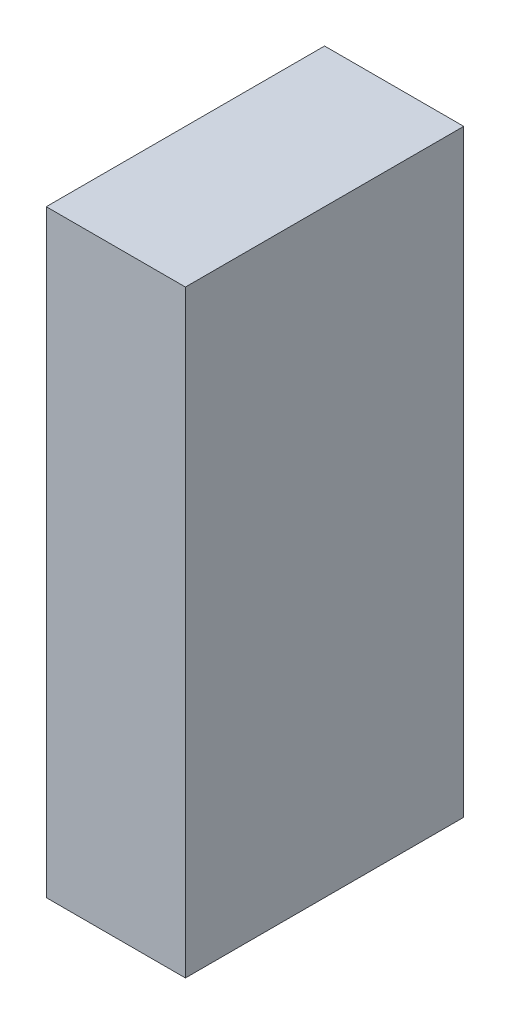
ISO-10303-21;
HEADER;
FILE_DESCRIPTION(('STEP AP214'),'2;1');
FILE_NAME('part.step','',(''),(''),'','','');
FILE_SCHEMA(('AUTOMOTIVE_DESIGN { 1 0 10303 214 1 1 1 1 }'));
ENDSEC;
DATA;
#1=APPLICATION_CONTEXT('core data for automotive mechanical design processes');
#2=APPLICATION_PROTOCOL_DEFINITION('international standard','automotive_design',2000,#1);
#3=PRODUCT_CONTEXT('',#1,'mechanical');
#4=PRODUCT('Part','Part','',(#3));
#5=PRODUCT_RELATED_PRODUCT_CATEGORY('part','',(#4));
#6=PRODUCT_DEFINITION_FORMATION('','',#4);
#7=PRODUCT_DEFINITION_CONTEXT('part definition',#1,'design');
#8=PRODUCT_DEFINITION('design','',#6,#7);
#9=PRODUCT_DEFINITION_SHAPE('','',#8);
#10=(LENGTH_UNIT() NAMED_UNIT(*) SI_UNIT(.MILLI.,.METRE.));
#11=(NAMED_UNIT(*) PLANE_ANGLE_UNIT() SI_UNIT($,.RADIAN.));
#12=(NAMED_UNIT(*) SI_UNIT($,.STERADIAN.) SOLID_ANGLE_UNIT());
#13=UNCERTAINTY_MEASURE_WITH_UNIT(LENGTH_MEASURE(1.E-05),#10,'distance_accuracy_value','');
#14=(GEOMETRIC_REPRESENTATION_CONTEXT(3) GLOBAL_UNCERTAINTY_ASSIGNED_CONTEXT((#13)) GLOBAL_UNIT_ASSIGNED_CONTEXT((#10,
#11,#12)) REPRESENTATION_CONTEXT('',''));
#15=CARTESIAN_POINT('',(0.,0.,0.));
#16=DIRECTION('',(0.,0.,1.));
#17=DIRECTION('',(1.,0.,0.));
#18=AXIS2_PLACEMENT_3D('',#15,#16,#17);
#19=CARTESIAN_POINT('',(0.25000204,-1.07499912,0.));
#20=DIRECTION('',(-1.,0.,0.));
#21=DIRECTION('',(0.,0.,1.));
#22=AXIS2_PLACEMENT_3D('',#19,#20,#21);
#23=PLANE('',#22);
#24=DIRECTION('',(0.,0.,-1.));
#25=VECTOR('',#24,1.);
#26=CARTESIAN_POINT('',(0.25000204,1.07500166,0.));
#27=LINE('',#26,#25);
#28=CARTESIAN_POINT('',(0.25000204,1.07500166,0.));
#29=VERTEX_POINT('',#28);
#30=CARTESIAN_POINT('',(0.25000204,1.07500166,1.00000054));
#31=VERTEX_POINT('',#30);
#32=EDGE_CURVE('E20',#29,#31,#27,.F.);
#33=ORIENTED_EDGE('',*,*,#32,.T.);
#34=DIRECTION('',(0.,1.,0.));
#35=VECTOR('',#34,1.);
#36=CARTESIAN_POINT('',(0.25000204,1.07500166,1.00000054));
#37=LINE('',#36,#35);
#38=CARTESIAN_POINT('',(0.25000204,-1.07499912,1.00000054));
#39=VERTEX_POINT('',#38);
#40=EDGE_CURVE('E55',#31,#39,#37,.F.);
#41=ORIENTED_EDGE('',*,*,#40,.T.);
#42=DIRECTION('',(0.,0.,1.));
#43=VECTOR('',#42,1.);
#44=CARTESIAN_POINT('',(0.25000204,-1.07499912,0.));
#45=LINE('',#44,#43);
#46=CARTESIAN_POINT('',(0.25000204,-1.07499912,0.));
#47=VERTEX_POINT('',#46);
#48=EDGE_CURVE('E76',#39,#47,#45,.F.);
#49=ORIENTED_EDGE('',*,*,#48,.T.);
#50=DIRECTION('',(0.,1.,0.));
#51=VECTOR('',#50,1.);
#52=CARTESIAN_POINT('',(0.25000204,1.07500166,0.));
#53=LINE('',#52,#51);
#54=EDGE_CURVE('E58',#29,#47,#53,.F.);
#55=ORIENTED_EDGE('',*,*,#54,.F.);
#56=EDGE_LOOP('',(#33,#41,#49,#55));
#57=FACE_BOUND('',#56,.T.);
#58=ADVANCED_FACE('F17',(#57),#23,.F.);
#59=CARTESIAN_POINT('',(0.25000204,1.07500166,0.));
#60=DIRECTION('',(0.,-1.,0.));
#61=DIRECTION('',(0.,0.,-1.));
#62=AXIS2_PLACEMENT_3D('',#59,#60,#61);
#63=PLANE('',#62);
#64=DIRECTION('',(0.,0.,-1.));
#65=VECTOR('',#64,1.);
#66=CARTESIAN_POINT('',(-0.2499995,1.07500166,0.));
#67=LINE('',#66,#65);
#68=CARTESIAN_POINT('',(-0.2499995,1.07500166,0.));
#69=VERTEX_POINT('',#68);
#70=CARTESIAN_POINT('',(-0.2499995,1.07500166,1.00000054));
#71=VERTEX_POINT('',#70);
#72=EDGE_CURVE('E73',#69,#71,#67,.F.);
#73=ORIENTED_EDGE('',*,*,#72,.T.);
#74=DIRECTION('',(-1.,0.,0.));
#75=VECTOR('',#74,1.);
#76=CARTESIAN_POINT('',(-0.2499995,1.07500166,1.00000054));
#77=LINE('',#76,#75);
#78=EDGE_CURVE('E63',#71,#31,#77,.F.);
#79=ORIENTED_EDGE('',*,*,#78,.T.);
#80=ORIENTED_EDGE('',*,*,#32,.F.);
#81=DIRECTION('',(-1.,0.,0.));
#82=VECTOR('',#81,1.);
#83=CARTESIAN_POINT('',(-0.2499995,1.07500166,0.));
#84=LINE('',#83,#82);
#85=EDGE_CURVE('E78',#69,#29,#84,.F.);
#86=ORIENTED_EDGE('',*,*,#85,.F.);
#87=EDGE_LOOP('',(#73,#79,#80,#86));
#88=FACE_BOUND('',#87,.T.);
#89=ADVANCED_FACE('F72',(#88),#63,.F.);
#90=CARTESIAN_POINT('',(-0.2499995,1.07500166,1.00000054));
#91=DIRECTION('',(0.,0.,-1.));
#92=DIRECTION('',(-1.,0.,0.));
#93=AXIS2_PLACEMENT_3D('',#90,#91,#92);
#94=PLANE('',#93);
#95=DIRECTION('',(1.,0.,0.));
#96=VECTOR('',#95,1.);
#97=CARTESIAN_POINT('',(-0.2499995,-1.07499912,1.00000054));
#98=LINE('',#97,#96);
#99=CARTESIAN_POINT('',(-0.2499995,-1.07499912,1.00000054));
#100=VERTEX_POINT('',#99);
#101=EDGE_CURVE('E69',#100,#39,#98,.T.);
#102=ORIENTED_EDGE('',*,*,#101,.T.);
#103=ORIENTED_EDGE('',*,*,#40,.F.);
#104=ORIENTED_EDGE('',*,*,#78,.F.);
#105=DIRECTION('',(0.,1.,0.));
#106=VECTOR('',#105,1.);
#107=CARTESIAN_POINT('',(-0.2499995,1.07500166,1.00000054));
#108=LINE('',#107,#106);
#109=EDGE_CURVE('E83',#71,#100,#108,.F.);
#110=ORIENTED_EDGE('',*,*,#109,.T.);
#111=EDGE_LOOP('',(#102,#103,#104,#110));
#112=FACE_BOUND('',#111,.T.);
#113=ADVANCED_FACE('F66',(#112),#94,.F.);
#114=CARTESIAN_POINT('',(-0.2499995,-1.07499912,0.));
#115=DIRECTION('',(0.,1.,0.));
#116=DIRECTION('',(0.,0.,1.));
#117=AXIS2_PLACEMENT_3D('',#114,#115,#116);
#118=PLANE('',#117);
#119=ORIENTED_EDGE('',*,*,#48,.F.);
#120=ORIENTED_EDGE('',*,*,#101,.F.);
#121=DIRECTION('',(0.,0.,-1.));
#122=VECTOR('',#121,1.);
#123=CARTESIAN_POINT('',(-0.2499995,-1.07499912,0.));
#124=LINE('',#123,#122);
#125=CARTESIAN_POINT('',(-0.2499995,-1.07499912,0.));
#126=VERTEX_POINT('',#125);
#127=EDGE_CURVE('E26',#100,#126,#124,.T.);
#128=ORIENTED_EDGE('',*,*,#127,.T.);
#129=DIRECTION('',(-1.,0.,0.));
#130=VECTOR('',#129,1.);
#131=CARTESIAN_POINT('',(-0.2499995,-1.07499912,0.));
#132=LINE('',#131,#130);
#133=EDGE_CURVE('E34',#47,#126,#132,.T.);
#134=ORIENTED_EDGE('',*,*,#133,.F.);
#135=EDGE_LOOP('',(#119,#120,#128,#134));
#136=FACE_BOUND('',#135,.T.);
#137=ADVANCED_FACE('F88',(#136),#118,.F.);
#138=CARTESIAN_POINT('',(-0.2499995,1.07500166,0.));
#139=DIRECTION('',(0.,0.,-1.));
#140=DIRECTION('',(-1.,0.,0.));
#141=AXIS2_PLACEMENT_3D('',#138,#139,#140);
#142=PLANE('',#141);
#143=ORIENTED_EDGE('',*,*,#133,.T.);
#144=DIRECTION('',(0.,1.,0.));
#145=VECTOR('',#144,1.);
#146=CARTESIAN_POINT('',(-0.2499995,1.07500166,0.));
#147=LINE('',#146,#145);
#148=EDGE_CURVE('E11',#126,#69,#147,.T.);
#149=ORIENTED_EDGE('',*,*,#148,.T.);
#150=ORIENTED_EDGE('',*,*,#85,.T.);
#151=ORIENTED_EDGE('',*,*,#54,.T.);
#152=EDGE_LOOP('',(#143,#149,#150,#151));
#153=FACE_BOUND('',#152,.T.);
#154=ADVANCED_FACE('F91',(#153),#142,.T.);
#155=CARTESIAN_POINT('',(-0.2499995,1.07500166,0.));
#156=DIRECTION('',(1.,0.,0.));
#157=DIRECTION('',(0.,0.,-1.));
#158=AXIS2_PLACEMENT_3D('',#155,#156,#157);
#159=PLANE('',#158);
#160=ORIENTED_EDGE('',*,*,#127,.F.);
#161=ORIENTED_EDGE('',*,*,#109,.F.);
#162=ORIENTED_EDGE('',*,*,#72,.F.);
#163=ORIENTED_EDGE('',*,*,#148,.F.);
#164=EDGE_LOOP('',(#160,#161,#162,#163));
#165=FACE_BOUND('',#164,.T.);
#166=ADVANCED_FACE('F90',(#165),#159,.F.);
#167=CLOSED_SHELL('',(#58,#89,#113,#137,#154,#166));
#168=MANIFOLD_SOLID_BREP('B1',#167);
#169=ADVANCED_BREP_SHAPE_REPRESENTATION('',(#18,#168),#14);
#170=SHAPE_DEFINITION_REPRESENTATION(#9,#169);
ENDSEC;
END-ISO-10303-21;
